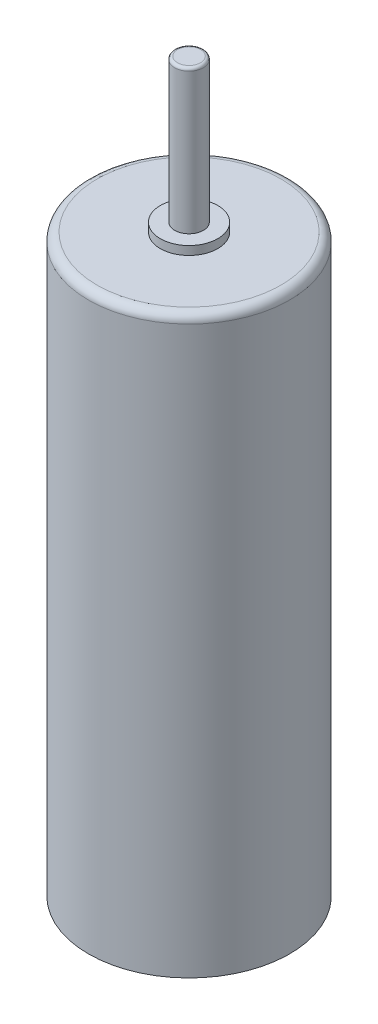
ISO-10303-21;
HEADER;
FILE_DESCRIPTION(('STEP AP214'),'2;1');
FILE_NAME('part.step','',(''),(''),'','','');
FILE_SCHEMA(('AUTOMOTIVE_DESIGN { 1 0 10303 214 1 1 1 1 }'));
ENDSEC;
DATA;
#1=APPLICATION_CONTEXT('core data for automotive mechanical design processes');
#2=APPLICATION_PROTOCOL_DEFINITION('international standard','automotive_design',2000,#1);
#3=PRODUCT_CONTEXT('',#1,'mechanical');
#4=PRODUCT('Part','Part','',(#3));
#5=PRODUCT_RELATED_PRODUCT_CATEGORY('part','',(#4));
#6=PRODUCT_DEFINITION_FORMATION('','',#4);
#7=PRODUCT_DEFINITION_CONTEXT('part definition',#1,'design');
#8=PRODUCT_DEFINITION('design','',#6,#7);
#9=PRODUCT_DEFINITION_SHAPE('','',#8);
#10=(LENGTH_UNIT() NAMED_UNIT(*) SI_UNIT(.MILLI.,.METRE.));
#11=(NAMED_UNIT(*) PLANE_ANGLE_UNIT() SI_UNIT($,.RADIAN.));
#12=(NAMED_UNIT(*) SI_UNIT($,.STERADIAN.) SOLID_ANGLE_UNIT());
#13=UNCERTAINTY_MEASURE_WITH_UNIT(LENGTH_MEASURE(1.E-05),#10,'distance_accuracy_value','');
#14=(GEOMETRIC_REPRESENTATION_CONTEXT(3) GLOBAL_UNCERTAINTY_ASSIGNED_CONTEXT((#13)) GLOBAL_UNIT_ASSIGNED_CONTEXT((#10,
#11,#12)) REPRESENTATION_CONTEXT('',''));
#15=CARTESIAN_POINT('',(0.,0.,0.));
#16=DIRECTION('',(0.,0.,1.));
#17=DIRECTION('',(1.,0.,0.));
#18=AXIS2_PLACEMENT_3D('',#15,#16,#17);
#19=CARTESIAN_POINT('',(0.,20.,0.));
#20=DIRECTION('',(0.,-1.,0.));
#21=DIRECTION('',(0.,0.,-1.));
#22=AXIS2_PLACEMENT_3D('',#19,#20,#21);
#23=CYLINDRICAL_SURFACE('',#22,3.5);
#24=CARTESIAN_POINT('',(0.,19.7,0.));
#25=DIRECTION('',(0.,1.,0.));
#26=DIRECTION('',(0.,0.,1.));
#27=AXIS2_PLACEMENT_3D('',#24,#25,#26);
#28=CIRCLE('',#27,3.5);
#29=CARTESIAN_POINT('',(0.,19.7,3.5));
#30=VERTEX_POINT('',#29);
#31=EDGE_CURVE('E59',#30,#30,#28,.F.);
#32=ORIENTED_EDGE('',*,*,#31,.T.);
#33=EDGE_LOOP('',(#32));
#34=FACE_BOUND('',#33,.T.);
#35=CARTESIAN_POINT('',(0.,0.,0.));
#36=DIRECTION('',(0.,1.,0.));
#37=DIRECTION('',(0.,0.,1.));
#38=AXIS2_PLACEMENT_3D('',#35,#36,#37);
#39=CIRCLE('',#38,3.5);
#40=CARTESIAN_POINT('',(0.,0.,3.5));
#41=VERTEX_POINT('',#40);
#42=EDGE_CURVE('E69',#41,#41,#39,.T.);
#43=ORIENTED_EDGE('',*,*,#42,.T.);
#44=EDGE_LOOP('',(#43));
#45=FACE_BOUND('',#44,.T.);
#46=ADVANCED_FACE('F41',(#34,#45),#23,.T.);
#47=CARTESIAN_POINT('',(0.,20.,0.));
#48=DIRECTION('',(0.,1.,0.));
#49=DIRECTION('',(0.,0.,1.));
#50=AXIS2_PLACEMENT_3D('',#47,#48,#49);
#51=PLANE('',#50);
#52=CARTESIAN_POINT('',(0.,20.,0.));
#53=DIRECTION('',(0.,1.,0.));
#54=DIRECTION('',(0.,0.,1.));
#55=AXIS2_PLACEMENT_3D('',#52,#53,#54);
#56=CIRCLE('',#55,1.);
#57=CARTESIAN_POINT('',(0.,20.,1.));
#58=VERTEX_POINT('',#57);
#59=EDGE_CURVE('E74',#58,#58,#56,.T.);
#60=ORIENTED_EDGE('',*,*,#59,.F.);
#61=EDGE_LOOP('',(#60));
#62=FACE_BOUND('',#61,.T.);
#63=CARTESIAN_POINT('',(0.,20.,0.));
#64=DIRECTION('',(0.,1.,0.));
#65=DIRECTION('',(0.,0.,1.));
#66=AXIS2_PLACEMENT_3D('',#63,#64,#65);
#67=CIRCLE('',#66,3.2);
#68=CARTESIAN_POINT('',(0.,20.,3.2));
#69=VERTEX_POINT('',#68);
#70=EDGE_CURVE('E65',#69,#69,#67,.T.);
#71=ORIENTED_EDGE('',*,*,#70,.T.);
#72=EDGE_LOOP('',(#71));
#73=FACE_BOUND('',#72,.T.);
#74=ADVANCED_FACE('F91',(#62,#73),#51,.T.);
#75=CARTESIAN_POINT('',(0.,0.,0.));
#76=DIRECTION('',(0.,1.,0.));
#77=DIRECTION('',(0.,0.,1.));
#78=AXIS2_PLACEMENT_3D('',#75,#76,#77);
#79=PLANE('',#78);
#80=ORIENTED_EDGE('',*,*,#42,.F.);
#81=EDGE_LOOP('',(#80));
#82=FACE_BOUND('',#81,.T.);
#83=ADVANCED_FACE('F94',(#82),#79,.F.);
#84=CARTESIAN_POINT('',(0.,19.7,0.));
#85=DIRECTION('',(0.,1.,0.));
#86=DIRECTION('',(0.,0.,1.));
#87=AXIS2_PLACEMENT_3D('',#84,#85,#86);
#88=TOROIDAL_SURFACE('',#87,3.2,0.3);
#89=ORIENTED_EDGE('',*,*,#31,.F.);
#90=EDGE_LOOP('',(#89));
#91=FACE_BOUND('',#90,.T.);
#92=ORIENTED_EDGE('',*,*,#70,.F.);
#93=EDGE_LOOP('',(#92));
#94=FACE_BOUND('',#93,.T.);
#95=ADVANCED_FACE('F87',(#91,#94),#88,.T.);
#96=CARTESIAN_POINT('',(0.,20.3,0.));
#97=DIRECTION('',(0.,-1.,0.));
#98=DIRECTION('',(0.,0.,-1.));
#99=AXIS2_PLACEMENT_3D('',#96,#97,#98);
#100=CYLINDRICAL_SURFACE('',#99,1.);
#101=CARTESIAN_POINT('',(0.,20.3,0.));
#102=DIRECTION('',(0.,1.,0.));
#103=DIRECTION('',(0.,0.,1.));
#104=AXIS2_PLACEMENT_3D('',#101,#102,#103);
#105=CIRCLE('',#104,1.);
#106=CARTESIAN_POINT('',(0.,20.3,1.));
#107=VERTEX_POINT('',#106);
#108=EDGE_CURVE('E73',#107,#107,#105,.T.);
#109=ORIENTED_EDGE('',*,*,#108,.F.);
#110=EDGE_LOOP('',(#109));
#111=FACE_BOUND('',#110,.T.);
#112=ORIENTED_EDGE('',*,*,#59,.T.);
#113=EDGE_LOOP('',(#112));
#114=FACE_BOUND('',#113,.T.);
#115=ADVANCED_FACE('F84',(#111,#114),#100,.T.);
#116=CARTESIAN_POINT('',(0.,20.3,0.));
#117=DIRECTION('',(0.,1.,0.));
#118=DIRECTION('',(0.,0.,1.));
#119=AXIS2_PLACEMENT_3D('',#116,#117,#118);
#120=PLANE('',#119);
#121=CARTESIAN_POINT('',(0.,20.3,0.));
#122=DIRECTION('',(0.,1.,0.));
#123=DIRECTION('',(0.,0.,1.));
#124=AXIS2_PLACEMENT_3D('',#121,#122,#123);
#125=CIRCLE('',#124,0.5);
#126=CARTESIAN_POINT('',(0.,20.3,0.5));
#127=VERTEX_POINT('',#126);
#128=EDGE_CURVE('E54',#127,#127,#125,.T.);
#129=ORIENTED_EDGE('',*,*,#128,.F.);
#130=EDGE_LOOP('',(#129));
#131=FACE_BOUND('',#130,.T.);
#132=ORIENTED_EDGE('',*,*,#108,.T.);
#133=EDGE_LOOP('',(#132));
#134=FACE_BOUND('',#133,.T.);
#135=ADVANCED_FACE('F82',(#131,#134),#120,.T.);
#136=CARTESIAN_POINT('',(0.,25.3,0.));
#137=DIRECTION('',(0.,-1.,0.));
#138=DIRECTION('',(0.,0.,-1.));
#139=AXIS2_PLACEMENT_3D('',#136,#137,#138);
#140=CYLINDRICAL_SURFACE('',#139,0.5);
#141=CARTESIAN_POINT('',(0.,25.2,0.));
#142=DIRECTION('',(0.,1.,0.));
#143=DIRECTION('',(0.,0.,1.));
#144=AXIS2_PLACEMENT_3D('',#141,#142,#143);
#145=CIRCLE('',#144,0.5);
#146=CARTESIAN_POINT('',(0.,25.2,0.5));
#147=VERTEX_POINT('',#146);
#148=EDGE_CURVE('E10',#147,#147,#145,.F.);
#149=ORIENTED_EDGE('',*,*,#148,.T.);
#150=EDGE_LOOP('',(#149));
#151=FACE_BOUND('',#150,.T.);
#152=ORIENTED_EDGE('',*,*,#128,.T.);
#153=EDGE_LOOP('',(#152));
#154=FACE_BOUND('',#153,.T.);
#155=ADVANCED_FACE('F115',(#151,#154),#140,.T.);
#156=CARTESIAN_POINT('',(0.,25.3,0.));
#157=DIRECTION('',(0.,1.,0.));
#158=DIRECTION('',(0.,0.,1.));
#159=AXIS2_PLACEMENT_3D('',#156,#157,#158);
#160=PLANE('',#159);
#161=CARTESIAN_POINT('',(0.,25.3,0.));
#162=DIRECTION('',(0.,1.,0.));
#163=DIRECTION('',(0.,0.,1.));
#164=AXIS2_PLACEMENT_3D('',#161,#162,#163);
#165=CIRCLE('',#164,0.4);
#166=CARTESIAN_POINT('',(0.,25.3,0.4));
#167=VERTEX_POINT('',#166);
#168=EDGE_CURVE('E49',#167,#167,#165,.T.);
#169=ORIENTED_EDGE('',*,*,#168,.T.);
#170=EDGE_LOOP('',(#169));
#171=FACE_BOUND('',#170,.T.);
#172=ADVANCED_FACE('F119',(#171),#160,.T.);
#173=CARTESIAN_POINT('',(0.,25.2,0.));
#174=DIRECTION('',(0.,1.,0.));
#175=DIRECTION('',(0.,0.,1.));
#176=AXIS2_PLACEMENT_3D('',#173,#174,#175);
#177=TOROIDAL_SURFACE('',#176,0.4,0.1);
#178=ORIENTED_EDGE('',*,*,#148,.F.);
#179=EDGE_LOOP('',(#178));
#180=FACE_BOUND('',#179,.T.);
#181=ORIENTED_EDGE('',*,*,#168,.F.);
#182=EDGE_LOOP('',(#181));
#183=FACE_BOUND('',#182,.T.);
#184=ADVANCED_FACE('F43',(#180,#183),#177,.T.);
#185=CLOSED_SHELL('',(#46,#74,#83,#95,#115,#135,#155,#172,#184));
#186=MANIFOLD_SOLID_BREP('B2',#185);
#187=ADVANCED_BREP_SHAPE_REPRESENTATION('',(#18,#186),#14);
#188=SHAPE_DEFINITION_REPRESENTATION(#9,#187);
ENDSEC;
END-ISO-10303-21;
